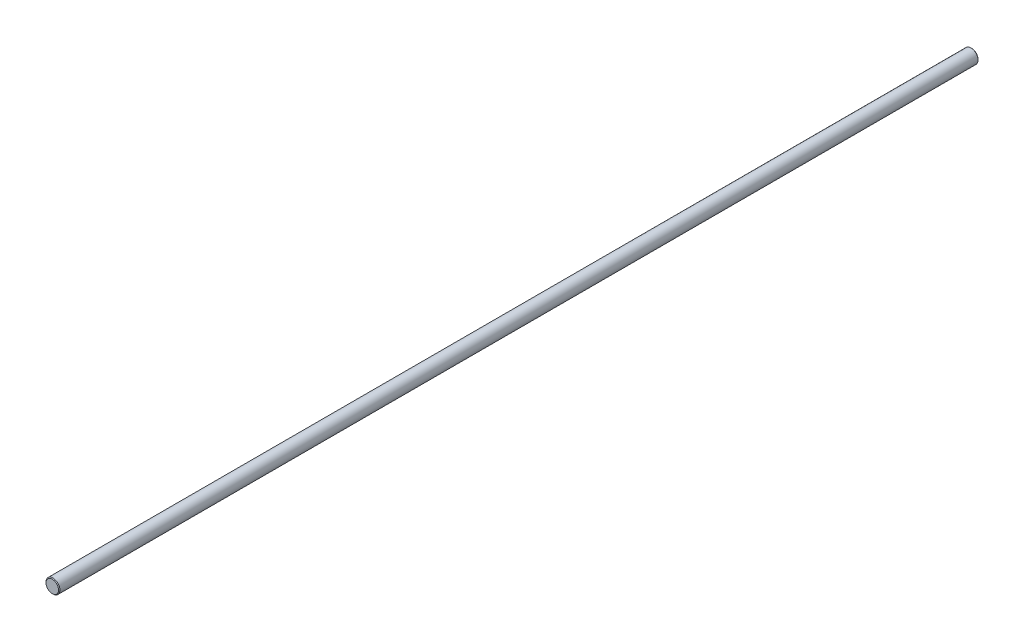
ISO-10303-21;
HEADER;
FILE_DESCRIPTION(('STEP AP214'),'2;1');
FILE_NAME('part.step','',(''),(''),'','','');
FILE_SCHEMA(('AUTOMOTIVE_DESIGN { 1 0 10303 214 1 1 1 1 }'));
ENDSEC;
DATA;
#1=APPLICATION_CONTEXT('core data for automotive mechanical design processes');
#2=APPLICATION_PROTOCOL_DEFINITION('international standard','automotive_design',2000,#1);
#3=PRODUCT_CONTEXT('',#1,'mechanical');
#4=PRODUCT('Part','Part','',(#3));
#5=PRODUCT_RELATED_PRODUCT_CATEGORY('part','',(#4));
#6=PRODUCT_DEFINITION_FORMATION('','',#4);
#7=PRODUCT_DEFINITION_CONTEXT('part definition',#1,'design');
#8=PRODUCT_DEFINITION('design','',#6,#7);
#9=PRODUCT_DEFINITION_SHAPE('','',#8);
#10=(LENGTH_UNIT() NAMED_UNIT(*) SI_UNIT(.MILLI.,.METRE.));
#11=(NAMED_UNIT(*) PLANE_ANGLE_UNIT() SI_UNIT($,.RADIAN.));
#12=(NAMED_UNIT(*) SI_UNIT($,.STERADIAN.) SOLID_ANGLE_UNIT());
#13=UNCERTAINTY_MEASURE_WITH_UNIT(LENGTH_MEASURE(1.E-05),#10,'distance_accuracy_value','');
#14=(GEOMETRIC_REPRESENTATION_CONTEXT(3) GLOBAL_UNCERTAINTY_ASSIGNED_CONTEXT((#13)) GLOBAL_UNIT_ASSIGNED_CONTEXT((#10,
#11,#12)) REPRESENTATION_CONTEXT('',''));
#15=CARTESIAN_POINT('',(0.,0.,0.));
#16=DIRECTION('',(0.,0.,1.));
#17=DIRECTION('',(1.,0.,0.));
#18=AXIS2_PLACEMENT_3D('',#15,#16,#17);
#19=CARTESIAN_POINT('',(0.,0.,528.));
#20=DIRECTION('',(0.,0.,-1.));
#21=DIRECTION('',(-1.,0.,0.));
#22=AXIS2_PLACEMENT_3D('',#19,#20,#21);
#23=CYLINDRICAL_SURFACE('',#22,4.);
#24=CARTESIAN_POINT('',(0.,0.,0.399999999999956));
#25=DIRECTION('',(0.,0.,1.));
#26=DIRECTION('',(1.,0.,0.));
#27=AXIS2_PLACEMENT_3D('',#24,#25,#26);
#28=CIRCLE('',#27,4.);
#29=CARTESIAN_POINT('',(4.,0.,0.399999999999956));
#30=VERTEX_POINT('',#29);
#31=EDGE_CURVE('E42',#30,#30,#28,.T.);
#32=ORIENTED_EDGE('',*,*,#31,.T.);
#33=EDGE_LOOP('',(#32));
#34=FACE_BOUND('',#33,.T.);
#35=CARTESIAN_POINT('',(0.,0.,527.6));
#36=DIRECTION('',(0.,0.,1.));
#37=DIRECTION('',(1.,0.,0.));
#38=AXIS2_PLACEMENT_3D('',#35,#36,#37);
#39=CIRCLE('',#38,4.);
#40=CARTESIAN_POINT('',(4.,0.,527.6));
#41=VERTEX_POINT('',#40);
#42=EDGE_CURVE('E46',#41,#41,#39,.F.);
#43=ORIENTED_EDGE('',*,*,#42,.T.);
#44=EDGE_LOOP('',(#43));
#45=FACE_BOUND('',#44,.T.);
#46=ADVANCED_FACE('F31',(#34,#45),#23,.T.);
#47=CARTESIAN_POINT('',(0.,0.,528.));
#48=DIRECTION('',(0.,0.,1.));
#49=DIRECTION('',(1.,0.,0.));
#50=AXIS2_PLACEMENT_3D('',#47,#48,#49);
#51=PLANE('',#50);
#52=CARTESIAN_POINT('',(0.,0.,528.));
#53=DIRECTION('',(0.,0.,1.));
#54=DIRECTION('',(1.,0.,0.));
#55=AXIS2_PLACEMENT_3D('',#52,#53,#54);
#56=CIRCLE('',#55,3.6000000000001);
#57=CARTESIAN_POINT('',(3.6000000000001,0.,528.));
#58=VERTEX_POINT('',#57);
#59=EDGE_CURVE('E10',#58,#58,#56,.T.);
#60=ORIENTED_EDGE('',*,*,#59,.T.);
#61=EDGE_LOOP('',(#60));
#62=FACE_BOUND('',#61,.T.);
#63=ADVANCED_FACE('F62',(#62),#51,.T.);
#64=CARTESIAN_POINT('',(0.,0.,0.));
#65=DIRECTION('',(0.,0.,1.));
#66=DIRECTION('',(1.,0.,0.));
#67=AXIS2_PLACEMENT_3D('',#64,#65,#66);
#68=PLANE('',#67);
#69=CARTESIAN_POINT('',(0.,0.,0.));
#70=DIRECTION('',(0.,0.,1.));
#71=DIRECTION('',(1.,0.,0.));
#72=AXIS2_PLACEMENT_3D('',#69,#70,#71);
#73=CIRCLE('',#72,3.59999999999999);
#74=CARTESIAN_POINT('',(3.59999999999999,0.,0.));
#75=VERTEX_POINT('',#74);
#76=EDGE_CURVE('E38',#75,#75,#73,.F.);
#77=ORIENTED_EDGE('',*,*,#76,.T.);
#78=EDGE_LOOP('',(#77));
#79=FACE_BOUND('',#78,.T.);
#80=ADVANCED_FACE('F59',(#79),#68,.F.);
#81=CARTESIAN_POINT('',(0.,0.,0.399999999999956));
#82=DIRECTION('',(0.,0.,1.));
#83=DIRECTION('',(1.,0.,0.));
#84=AXIS2_PLACEMENT_3D('',#81,#82,#83);
#85=CONICAL_SURFACE('',#84,4.,0.785398163397513);
#86=ORIENTED_EDGE('',*,*,#76,.F.);
#87=EDGE_LOOP('',(#86));
#88=FACE_BOUND('',#87,.T.);
#89=ORIENTED_EDGE('',*,*,#31,.F.);
#90=EDGE_LOOP('',(#89));
#91=FACE_BOUND('',#90,.T.);
#92=ADVANCED_FACE('F55',(#88,#91),#85,.T.);
#93=CARTESIAN_POINT('',(0.,0.,528.));
#94=DIRECTION('',(0.,0.,-1.));
#95=DIRECTION('',(-1.,0.,0.));
#96=AXIS2_PLACEMENT_3D('',#93,#94,#95);
#97=CONICAL_SURFACE('',#96,3.6000000000001,0.785398163397513);
#98=ORIENTED_EDGE('',*,*,#42,.F.);
#99=EDGE_LOOP('',(#98));
#100=FACE_BOUND('',#99,.T.);
#101=ORIENTED_EDGE('',*,*,#59,.F.);
#102=EDGE_LOOP('',(#101));
#103=FACE_BOUND('',#102,.T.);
#104=ADVANCED_FACE('F33',(#100,#103),#97,.T.);
#105=CLOSED_SHELL('',(#46,#63,#80,#92,#104));
#106=MANIFOLD_SOLID_BREP('B2',#105);
#107=ADVANCED_BREP_SHAPE_REPRESENTATION('',(#18,#106),#14);
#108=SHAPE_DEFINITION_REPRESENTATION(#9,#107);
ENDSEC;
END-ISO-10303-21;
